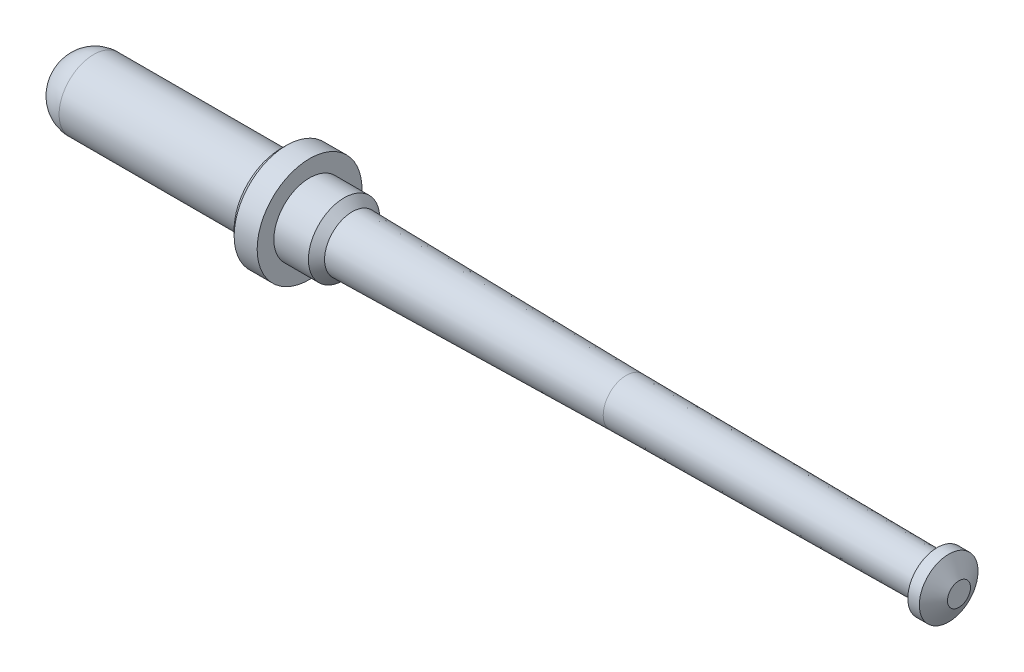
ISO-10303-21;
HEADER;
FILE_DESCRIPTION(('STEP AP214'),'2;1');
FILE_NAME('part.step','',(''),(''),'','','');
FILE_SCHEMA(('AUTOMOTIVE_DESIGN { 1 0 10303 214 1 1 1 1 }'));
ENDSEC;
DATA;
#1=APPLICATION_CONTEXT('core data for automotive mechanical design processes');
#2=APPLICATION_PROTOCOL_DEFINITION('international standard','automotive_design',2000,#1);
#3=PRODUCT_CONTEXT('',#1,'mechanical');
#4=PRODUCT('Part','Part','',(#3));
#5=PRODUCT_RELATED_PRODUCT_CATEGORY('part','',(#4));
#6=PRODUCT_DEFINITION_FORMATION('','',#4);
#7=PRODUCT_DEFINITION_CONTEXT('part definition',#1,'design');
#8=PRODUCT_DEFINITION('design','',#6,#7);
#9=PRODUCT_DEFINITION_SHAPE('','',#8);
#10=(LENGTH_UNIT() NAMED_UNIT(*) SI_UNIT(.MILLI.,.METRE.));
#11=(NAMED_UNIT(*) PLANE_ANGLE_UNIT() SI_UNIT($,.RADIAN.));
#12=(NAMED_UNIT(*) SI_UNIT($,.STERADIAN.) SOLID_ANGLE_UNIT());
#13=UNCERTAINTY_MEASURE_WITH_UNIT(LENGTH_MEASURE(1.E-05),#10,'distance_accuracy_value','');
#14=(GEOMETRIC_REPRESENTATION_CONTEXT(3) GLOBAL_UNCERTAINTY_ASSIGNED_CONTEXT((#13)) GLOBAL_UNIT_ASSIGNED_CONTEXT((#10,
#11,#12)) REPRESENTATION_CONTEXT('',''));
#15=CARTESIAN_POINT('',(0.,0.,0.));
#16=DIRECTION('',(0.,0.,1.));
#17=DIRECTION('',(1.,0.,0.));
#18=AXIS2_PLACEMENT_3D('',#15,#16,#17);
#19=CARTESIAN_POINT('',(0.,0.0125,0.));
#20=DIRECTION('',(-1.,0.,0.));
#21=DIRECTION('',(0.,0.,1.));
#22=AXIS2_PLACEMENT_3D('',#19,#20,#21);
#23=PLANE('',#22);
#24=CARTESIAN_POINT('',(0.,0.,0.));
#25=DIRECTION('',(1.,0.,0.));
#26=DIRECTION('',(0.,0.,-1.));
#27=AXIS2_PLACEMENT_3D('',#24,#25,#26);
#28=CIRCLE('',#27,0.0250000000000001);
#29=CARTESIAN_POINT('',(0.,0.,-0.0250000000000001));
#30=VERTEX_POINT('',#29);
#31=EDGE_CURVE('E17',#30,#30,#28,.T.);
#32=ORIENTED_EDGE('',*,*,#31,.F.);
#33=EDGE_LOOP('',(#32));
#34=FACE_BOUND('',#33,.T.);
#35=ADVANCED_FACE('F14',(#34),#23,.T.);
#36=CARTESIAN_POINT('',(0.275,0.,0.));
#37=DIRECTION('',(1.,0.,0.));
#38=DIRECTION('',(0.,1.,0.));
#39=AXIS2_PLACEMENT_3D('',#36,#37,#38);
#40=DEGENERATE_TOROIDAL_SURFACE('',#39,0.025,0.275,.T.);
#41=ORIENTED_EDGE('',*,*,#31,.T.);
#42=EDGE_LOOP('',(#41));
#43=FACE_BOUND('',#42,.T.);
#44=CARTESIAN_POINT('',(0.275,0.,0.));
#45=DIRECTION('',(-1.,0.,0.));
#46=DIRECTION('',(0.,0.,1.));
#47=AXIS2_PLACEMENT_3D('',#44,#45,#46);
#48=CIRCLE('',#47,0.3);
#49=CARTESIAN_POINT('',(0.275,0.,0.3));
#50=VERTEX_POINT('',#49);
#51=EDGE_CURVE('E40',#50,#50,#48,.F.);
#52=ORIENTED_EDGE('',*,*,#51,.F.);
#53=EDGE_LOOP('',(#52));
#54=FACE_BOUND('',#53,.T.);
#55=ADVANCED_FACE('F65',(#43,#54),#40,.T.);
#56=CARTESIAN_POINT('',(1.0875,0.,0.));
#57=DIRECTION('',(-1.,0.,0.));
#58=DIRECTION('',(0.,0.,1.));
#59=AXIS2_PLACEMENT_3D('',#56,#57,#58);
#60=CYLINDRICAL_SURFACE('',#59,0.3);
#61=ORIENTED_EDGE('',*,*,#51,.T.);
#62=EDGE_LOOP('',(#61));
#63=FACE_BOUND('',#62,.T.);
#64=CARTESIAN_POINT('',(1.9,0.,0.));
#65=DIRECTION('',(-1.,0.,0.));
#66=DIRECTION('',(0.,0.,1.));
#67=AXIS2_PLACEMENT_3D('',#64,#65,#66);
#68=CIRCLE('',#67,0.3);
#69=CARTESIAN_POINT('',(1.9,0.,0.3));
#70=VERTEX_POINT('',#69);
#71=EDGE_CURVE('E43',#70,#70,#68,.F.);
#72=ORIENTED_EDGE('',*,*,#71,.F.);
#73=EDGE_LOOP('',(#72));
#74=FACE_BOUND('',#73,.T.);
#75=ADVANCED_FACE('F63',(#63,#74),#60,.T.);
#76=CARTESIAN_POINT('',(1.9,0.3525,0.));
#77=DIRECTION('',(-1.,0.,0.));
#78=DIRECTION('',(0.,0.,1.));
#79=AXIS2_PLACEMENT_3D('',#76,#77,#78);
#80=PLANE('',#79);
#81=CARTESIAN_POINT('',(1.90000000003465,0.,0.));
#82=DIRECTION('',(1.,0.,0.));
#83=DIRECTION('',(0.,0.,-1.));
#84=AXIS2_PLACEMENT_3D('',#81,#82,#83);
#85=CIRCLE('',#84,0.405000000000655);
#86=CARTESIAN_POINT('',(1.90000000003465,0.,-0.405000000000655));
#87=VERTEX_POINT('',#86);
#88=EDGE_CURVE('E56',#87,#87,#85,.T.);
#89=ORIENTED_EDGE('',*,*,#88,.F.);
#90=EDGE_LOOP('',(#89));
#91=FACE_BOUND('',#90,.T.);
#92=ORIENTED_EDGE('',*,*,#71,.T.);
#93=EDGE_LOOP('',(#92));
#94=FACE_BOUND('',#93,.T.);
#95=ADVANCED_FACE('F61',(#91,#94),#80,.T.);
#96=CARTESIAN_POINT('',(7.78948929172439,0.0499999999999998,0.));
#97=DIRECTION('',(-1.,0.,0.));
#98=DIRECTION('',(0.,0.,1.));
#99=AXIS2_PLACEMENT_3D('',#96,#97,#98);
#100=PLANE('',#99);
#101=CARTESIAN_POINT('',(7.78948929166745,0.,0.));
#102=DIRECTION('',(-1.,0.,0.));
#103=DIRECTION('',(0.,0.,1.));
#104=AXIS2_PLACEMENT_3D('',#101,#102,#103);
#105=CIRCLE('',#104,0.100000000031741);
#106=CARTESIAN_POINT('',(7.78948929166745,0.,0.100000000031741));
#107=VERTEX_POINT('',#106);
#108=EDGE_CURVE('E39',#107,#107,#105,.T.);
#109=ORIENTED_EDGE('',*,*,#108,.F.);
#110=EDGE_LOOP('',(#109));
#111=FACE_BOUND('',#110,.T.);
#112=ADVANCED_FACE('F73',(#111),#100,.F.);
#113=CARTESIAN_POINT('',(1.9500000000221,0.,0.));
#114=DIRECTION('',(1.,0.,0.));
#115=DIRECTION('',(0.,0.,-1.));
#116=AXIS2_PLACEMENT_3D('',#113,#114,#115);
#117=CONICAL_SURFACE('',#116,0.454999999988104,0.785398163397448);
#118=CARTESIAN_POINT('',(1.95,0.,0.));
#119=DIRECTION('',(-1.,0.,0.));
#120=DIRECTION('',(0.,0.,1.));
#121=AXIS2_PLACEMENT_3D('',#118,#119,#120);
#122=CIRCLE('',#121,0.455);
#123=CARTESIAN_POINT('',(1.95,0.,0.455));
#124=VERTEX_POINT('',#123);
#125=EDGE_CURVE('E36',#124,#124,#122,.F.);
#126=ORIENTED_EDGE('',*,*,#125,.F.);
#127=EDGE_LOOP('',(#126));
#128=FACE_BOUND('',#127,.T.);
#129=ORIENTED_EDGE('',*,*,#88,.T.);
#130=EDGE_LOOP('',(#129));
#131=FACE_BOUND('',#130,.T.);
#132=ADVANCED_FACE('F115',(#128,#131),#117,.T.);
#133=CARTESIAN_POINT('',(7.69999999994297,0.,0.));
#134=DIRECTION('',(-1.,0.,0.));
#135=DIRECTION('',(0.,0.,1.));
#136=AXIS2_PLACEMENT_3D('',#133,#134,#135);
#137=CONICAL_SURFACE('',#136,0.255000000038308,1.04719755121454);
#138=CARTESIAN_POINT('',(7.7,0.,0.));
#139=DIRECTION('',(-1.,0.,0.));
#140=DIRECTION('',(0.,0.,1.));
#141=AXIS2_PLACEMENT_3D('',#138,#139,#140);
#142=CIRCLE('',#141,0.255);
#143=CARTESIAN_POINT('',(7.7,0.,0.255));
#144=VERTEX_POINT('',#143);
#145=EDGE_CURVE('E32',#144,#144,#142,.T.);
#146=ORIENTED_EDGE('',*,*,#145,.F.);
#147=EDGE_LOOP('',(#146));
#148=FACE_BOUND('',#147,.T.);
#149=ORIENTED_EDGE('',*,*,#108,.T.);
#150=EDGE_LOOP('',(#149));
#151=FACE_BOUND('',#150,.T.);
#152=ADVANCED_FACE('F111',(#148,#151),#137,.T.);
#153=CARTESIAN_POINT('',(2.05,0.,0.));
#154=DIRECTION('',(-1.,0.,0.));
#155=DIRECTION('',(0.,0.,1.));
#156=AXIS2_PLACEMENT_3D('',#153,#154,#155);
#157=CYLINDRICAL_SURFACE('',#156,0.455);
#158=CARTESIAN_POINT('',(2.15,0.,0.));
#159=DIRECTION('',(-1.,0.,0.));
#160=DIRECTION('',(0.,0.,1.));
#161=AXIS2_PLACEMENT_3D('',#158,#159,#160);
#162=CIRCLE('',#161,0.455);
#163=CARTESIAN_POINT('',(2.15,0.,0.455));
#164=VERTEX_POINT('',#163);
#165=EDGE_CURVE('E35',#164,#164,#162,.T.);
#166=ORIENTED_EDGE('',*,*,#165,.T.);
#167=EDGE_LOOP('',(#166));
#168=FACE_BOUND('',#167,.T.);
#169=ORIENTED_EDGE('',*,*,#125,.T.);
#170=EDGE_LOOP('',(#169));
#171=FACE_BOUND('',#170,.T.);
#172=ADVANCED_FACE('F107',(#168,#171),#157,.T.);
#173=CARTESIAN_POINT('',(7.65,0.,0.));
#174=DIRECTION('',(-1.,0.,0.));
#175=DIRECTION('',(0.,0.,1.));
#176=AXIS2_PLACEMENT_3D('',#173,#174,#175);
#177=CYLINDRICAL_SURFACE('',#176,0.255);
#178=CARTESIAN_POINT('',(7.6,0.,0.));
#179=DIRECTION('',(-1.,0.,0.));
#180=DIRECTION('',(0.,0.,1.));
#181=AXIS2_PLACEMENT_3D('',#178,#179,#180);
#182=CIRCLE('',#181,0.255);
#183=CARTESIAN_POINT('',(7.6,0.,0.255));
#184=VERTEX_POINT('',#183);
#185=EDGE_CURVE('E49',#184,#184,#182,.T.);
#186=ORIENTED_EDGE('',*,*,#185,.F.);
#187=EDGE_LOOP('',(#186));
#188=FACE_BOUND('',#187,.T.);
#189=ORIENTED_EDGE('',*,*,#145,.T.);
#190=EDGE_LOOP('',(#189));
#191=FACE_BOUND('',#190,.T.);
#192=ADVANCED_FACE('F103',(#188,#191),#177,.T.);
#193=CARTESIAN_POINT('',(2.15,0.3825,0.));
#194=DIRECTION('',(-1.,0.,0.));
#195=DIRECTION('',(0.,0.,1.));
#196=AXIS2_PLACEMENT_3D('',#193,#194,#195);
#197=PLANE('',#196);
#198=CARTESIAN_POINT('',(2.15,0.,0.));
#199=DIRECTION('',(-1.,0.,0.));
#200=DIRECTION('',(0.,0.,1.));
#201=AXIS2_PLACEMENT_3D('',#198,#199,#200);
#202=CIRCLE('',#201,0.31);
#203=CARTESIAN_POINT('',(2.15,0.,0.31));
#204=VERTEX_POINT('',#203);
#205=EDGE_CURVE('E46',#204,#204,#202,.F.);
#206=ORIENTED_EDGE('',*,*,#205,.F.);
#207=EDGE_LOOP('',(#206));
#208=FACE_BOUND('',#207,.T.);
#209=ORIENTED_EDGE('',*,*,#165,.F.);
#210=EDGE_LOOP('',(#209));
#211=FACE_BOUND('',#210,.T.);
#212=ADVANCED_FACE('F99',(#208,#211),#197,.F.);
#213=CARTESIAN_POINT('',(7.6,0.1275,0.));
#214=DIRECTION('',(-1.,0.,0.));
#215=DIRECTION('',(0.,0.,1.));
#216=AXIS2_PLACEMENT_3D('',#213,#214,#215);
#217=PLANE('',#216);
#218=CARTESIAN_POINT('',(7.60000000002492,0.,0.));
#219=DIRECTION('',(-1.,0.,0.));
#220=DIRECTION('',(0.,0.,1.));
#221=AXIS2_PLACEMENT_3D('',#218,#219,#220);
#222=CIRCLE('',#221,0.175000000000118);
#223=CARTESIAN_POINT('',(7.60000000002492,0.,0.175000000000118));
#224=VERTEX_POINT('',#223);
#225=EDGE_CURVE('E31',#224,#224,#222,.T.);
#226=ORIENTED_EDGE('',*,*,#225,.F.);
#227=EDGE_LOOP('',(#226));
#228=FACE_BOUND('',#227,.T.);
#229=ORIENTED_EDGE('',*,*,#185,.T.);
#230=EDGE_LOOP('',(#229));
#231=FACE_BOUND('',#230,.T.);
#232=ADVANCED_FACE('F95',(#228,#231),#217,.T.);
#233=CARTESIAN_POINT('',(2.3,0.,0.));
#234=DIRECTION('',(-1.,0.,0.));
#235=DIRECTION('',(0.,0.,1.));
#236=AXIS2_PLACEMENT_3D('',#233,#234,#235);
#237=CYLINDRICAL_SURFACE('',#236,0.31);
#238=CARTESIAN_POINT('',(2.45000000001028,0.,0.));
#239=DIRECTION('',(-1.,0.,0.));
#240=DIRECTION('',(0.,1.,0.));
#241=AXIS2_PLACEMENT_3D('',#238,#239,#240);
#242=CIRCLE('',#241,0.310000000013133);
#243=CARTESIAN_POINT('',(2.45000000001028,0.310000000013133,0.));
#244=VERTEX_POINT('',#243);
#245=EDGE_CURVE('E26',#244,#244,#242,.F.);
#246=ORIENTED_EDGE('',*,*,#245,.F.);
#247=EDGE_LOOP('',(#246));
#248=FACE_BOUND('',#247,.T.);
#249=ORIENTED_EDGE('',*,*,#205,.T.);
#250=EDGE_LOOP('',(#249));
#251=FACE_BOUND('',#250,.T.);
#252=ADVANCED_FACE('F91',(#248,#251),#237,.T.);
#253=CARTESIAN_POINT('',(4.90000000013424,0.,0.));
#254=DIRECTION('',(-1.,0.,0.));
#255=DIRECTION('',(0.,0.,1.));
#256=AXIS2_PLACEMENT_3D('',#253,#254,#255);
#257=CONICAL_SURFACE('',#256,0.199999999999534,0.00925899466228145);
#258=CARTESIAN_POINT('',(4.90000000002055,0.,0.));
#259=DIRECTION('',(-1.,0.,0.));
#260=DIRECTION('',(0.,1.,0.));
#261=AXIS2_PLACEMENT_3D('',#258,#259,#260);
#262=CIRCLE('',#261,0.199999999997758);
#263=CARTESIAN_POINT('',(4.90000000002055,0.199999999997758,0.));
#264=VERTEX_POINT('',#263);
#265=EDGE_CURVE('E21',#264,#264,#262,.T.);
#266=ORIENTED_EDGE('',*,*,#265,.F.);
#267=EDGE_LOOP('',(#266));
#268=FACE_BOUND('',#267,.T.);
#269=ORIENTED_EDGE('',*,*,#225,.T.);
#270=EDGE_LOOP('',(#269));
#271=FACE_BOUND('',#270,.T.);
#272=ADVANCED_FACE('F85',(#268,#271),#257,.T.);
#273=CARTESIAN_POINT('',(2.45000000012396,0.,0.));
#274=DIRECTION('',(-1.,0.,0.));
#275=DIRECTION('',(0.,0.,1.));
#276=AXIS2_PLACEMENT_3D('',#273,#274,#275);
#277=CONICAL_SURFACE('',#276,0.30999999995629,0.785398163803473);
#278=CARTESIAN_POINT('',(2.52000000000407,0.,0.));
#279=DIRECTION('',(-1.,0.,0.));
#280=DIRECTION('',(0.,1.,0.));
#281=AXIS2_PLACEMENT_3D('',#278,#279,#280);
#282=CIRCLE('',#281,0.23999999999802);
#283=CARTESIAN_POINT('',(2.52000000000407,0.23999999999802,0.));
#284=VERTEX_POINT('',#283);
#285=EDGE_CURVE('E9',#284,#284,#282,.F.);
#286=ORIENTED_EDGE('',*,*,#285,.F.);
#287=EDGE_LOOP('',(#286));
#288=FACE_BOUND('',#287,.T.);
#289=ORIENTED_EDGE('',*,*,#245,.T.);
#290=EDGE_LOOP('',(#289));
#291=FACE_BOUND('',#290,.T.);
#292=ADVANCED_FACE('F79',(#288,#291),#277,.T.);
#293=CARTESIAN_POINT('',(2.52000000011776,0.,0.));
#294=DIRECTION('',(-1.,0.,0.));
#295=DIRECTION('',(0.,0.,1.));
#296=AXIS2_PLACEMENT_3D('',#293,#294,#295);
#297=CONICAL_SURFACE('',#296,0.239999999996243,0.0168051405150357);
#298=ORIENTED_EDGE('',*,*,#265,.T.);
#299=EDGE_LOOP('',(#298));
#300=FACE_BOUND('',#299,.T.);
#301=ORIENTED_EDGE('',*,*,#285,.T.);
#302=EDGE_LOOP('',(#301));
#303=FACE_BOUND('',#302,.T.);
#304=ADVANCED_FACE('F77',(#300,#303),#297,.T.);
#305=CLOSED_SHELL('',(#35,#55,#75,#95,#112,#132,#152,#172,#192,#212,#232,#252,#272,#292,#304));
#306=MANIFOLD_SOLID_BREP('B1',#305);
#307=ADVANCED_BREP_SHAPE_REPRESENTATION('',(#18,#306),#14);
#308=SHAPE_DEFINITION_REPRESENTATION(#9,#307);
ENDSEC;
END-ISO-10303-21;
